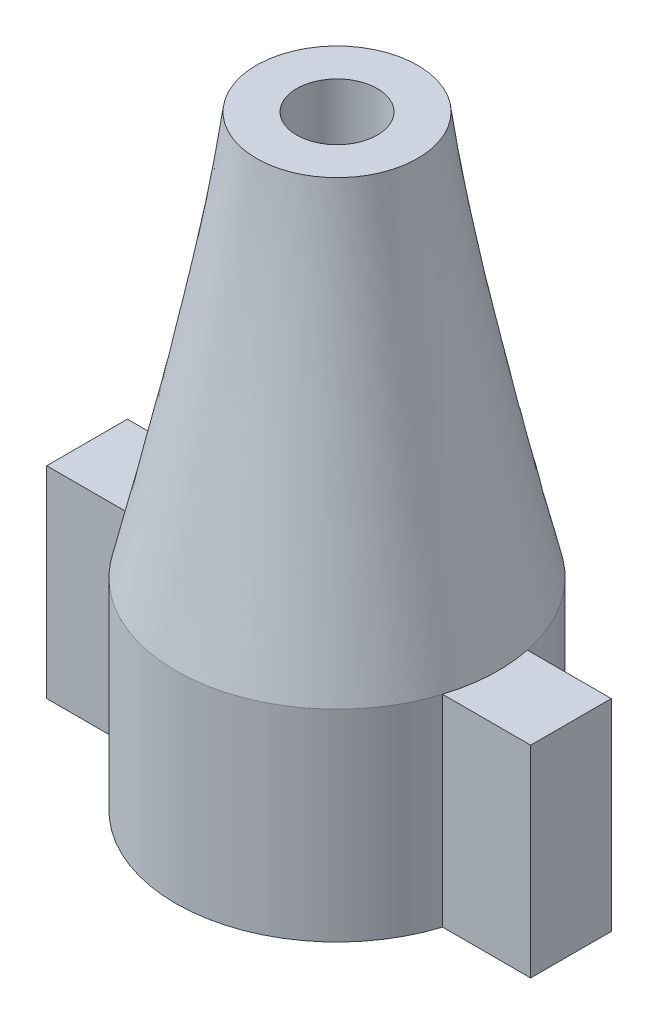
ISO-10303-21;
HEADER;
FILE_DESCRIPTION(('STEP AP214'),'2;1');
FILE_NAME('part.step','',(''),(''),'','','');
FILE_SCHEMA(('AUTOMOTIVE_DESIGN { 1 0 10303 214 1 1 1 1 }'));
ENDSEC;
DATA;
#1=APPLICATION_CONTEXT('core data for automotive mechanical design processes');
#2=APPLICATION_PROTOCOL_DEFINITION('international standard','automotive_design',2000,#1);
#3=PRODUCT_CONTEXT('',#1,'mechanical');
#4=PRODUCT('Part','Part','',(#3));
#5=PRODUCT_RELATED_PRODUCT_CATEGORY('part','',(#4));
#6=PRODUCT_DEFINITION_FORMATION('','',#4);
#7=PRODUCT_DEFINITION_CONTEXT('part definition',#1,'design');
#8=PRODUCT_DEFINITION('design','',#6,#7);
#9=PRODUCT_DEFINITION_SHAPE('','',#8);
#10=(LENGTH_UNIT() NAMED_UNIT(*) SI_UNIT(.MILLI.,.METRE.));
#11=(NAMED_UNIT(*) PLANE_ANGLE_UNIT() SI_UNIT($,.RADIAN.));
#12=(NAMED_UNIT(*) SI_UNIT($,.STERADIAN.) SOLID_ANGLE_UNIT());
#13=UNCERTAINTY_MEASURE_WITH_UNIT(LENGTH_MEASURE(1.E-05),#10,'distance_accuracy_value','');
#14=(GEOMETRIC_REPRESENTATION_CONTEXT(3) GLOBAL_UNCERTAINTY_ASSIGNED_CONTEXT((#13)) GLOBAL_UNIT_ASSIGNED_CONTEXT((#10,
#11,#12)) REPRESENTATION_CONTEXT('',''));
#15=CARTESIAN_POINT('',(0.,0.,0.));
#16=DIRECTION('',(0.,0.,1.));
#17=DIRECTION('',(1.,0.,0.));
#18=AXIS2_PLACEMENT_3D('',#15,#16,#17);
#19=CARTESIAN_POINT('',(0.,-5.,0.));
#20=DIRECTION('',(0.,1.,0.));
#21=DIRECTION('',(0.,0.,1.));
#22=AXIS2_PLACEMENT_3D('',#19,#20,#21);
#23=CYLINDRICAL_SURFACE('',#22,4.);
#24=CARTESIAN_POINT('',(0.,-5.,0.));
#25=DIRECTION('',(0.,-1.,0.));
#26=DIRECTION('',(0.,0.,-1.));
#27=AXIS2_PLACEMENT_3D('',#24,#25,#26);
#28=CIRCLE('',#27,4.);
#29=CARTESIAN_POINT('',(-3.91905509174876,-5.,-0.800629244930589));
#30=VERTEX_POINT('',#29);
#31=CARTESIAN_POINT('',(3.91905509174876,-5.,-0.800629244930588));
#32=VERTEX_POINT('',#31);
#33=EDGE_CURVE('E189',#30,#32,#28,.T.);
#34=ORIENTED_EDGE('',*,*,#33,.F.);
#35=DIRECTION('',(0.,1.,0.));
#36=VECTOR('',#35,1.);
#37=CARTESIAN_POINT('',(-3.91905509174876,-5.,-0.800629244930588));
#38=LINE('',#37,#36);
#39=CARTESIAN_POINT('',(-3.91905509174876,0.,-0.800629244930588));
#40=VERTEX_POINT('',#39);
#41=EDGE_CURVE('E12',#30,#40,#38,.T.);
#42=ORIENTED_EDGE('',*,*,#41,.T.);
#43=CARTESIAN_POINT('',(0.,0.,0.));
#44=DIRECTION('',(0.,-1.,0.));
#45=DIRECTION('',(0.,0.,-1.));
#46=AXIS2_PLACEMENT_3D('',#43,#44,#45);
#47=CIRCLE('',#46,4.);
#48=CARTESIAN_POINT('',(3.91905509174876,0.,-0.800629244930588));
#49=VERTEX_POINT('',#48);
#50=EDGE_CURVE('E239',#40,#49,#47,.T.);
#51=ORIENTED_EDGE('',*,*,#50,.T.);
#52=DIRECTION('',(0.,1.,0.));
#53=VECTOR('',#52,1.);
#54=CARTESIAN_POINT('',(3.91905509174876,-5.,-0.800629244930588));
#55=LINE('',#54,#53);
#56=EDGE_CURVE('E278',#49,#32,#55,.F.);
#57=ORIENTED_EDGE('',*,*,#56,.T.);
#58=EDGE_LOOP('',(#34,#42,#51,#57));
#59=FACE_BOUND('',#58,.T.);
#60=ADVANCED_FACE('F62',(#59),#23,.T.);
#61=CARTESIAN_POINT('',(0.,10.,0.));
#62=DIRECTION('',(0.,1.,0.));
#63=DIRECTION('',(0.,0.,1.));
#64=AXIS2_PLACEMENT_3D('',#61,#62,#63);
#65=PLANE('',#64);
#66=CARTESIAN_POINT('',(0.,10.,0.));
#67=DIRECTION('',(0.,1.,0.));
#68=DIRECTION('',(0.,0.,1.));
#69=AXIS2_PLACEMENT_3D('',#66,#67,#68);
#70=CIRCLE('',#69,1.);
#71=CARTESIAN_POINT('',(0.,10.,1.));
#72=VERTEX_POINT('',#71);
#73=EDGE_CURVE('E148',#72,#72,#70,.T.);
#74=ORIENTED_EDGE('',*,*,#73,.F.);
#75=EDGE_LOOP('',(#74));
#76=FACE_BOUND('',#75,.T.);
#77=CARTESIAN_POINT('',(0.,10.,0.));
#78=DIRECTION('',(0.,1.,0.));
#79=DIRECTION('',(0.,0.,1.));
#80=AXIS2_PLACEMENT_3D('',#77,#78,#79);
#81=CIRCLE('',#80,2.);
#82=CARTESIAN_POINT('',(0.,10.,2.));
#83=VERTEX_POINT('',#82);
#84=EDGE_CURVE('E188',#83,#83,#81,.F.);
#85=ORIENTED_EDGE('',*,*,#84,.F.);
#86=EDGE_LOOP('',(#85));
#87=FACE_BOUND('',#86,.T.);
#88=ADVANCED_FACE('F64',(#76,#87),#65,.T.);
#89=CARTESIAN_POINT('',(3.5279812011762,0.,1.88503279657075));
#90=CARTESIAN_POINT('',(1.98531269592162,10.,-0.241936974049907));
#91=CARTESIAN_POINT('',(7.2980467943177,0.,-5.17092960578165));
#92=CARTESIAN_POINT('',(1.50143874782181,10.,-4.21256236589315));
#93=CARTESIAN_POINT('',(0.242084391965302,0.,-8.94099519892315));
#94=CARTESIAN_POINT('',(-2.46918664402143,10.,-3.72868841779334));
#95=CARTESIAN_POINT('',(-3.5279812011762,0.,-1.88503279657075));
#96=CARTESIAN_POINT('',(-1.98531269592162,10.,0.241936974049907));
#97=CARTESIAN_POINT('',(-7.2980467943177,0.,5.17092960578165));
#98=CARTESIAN_POINT('',(-1.50143874782181,10.,4.21256236589315));
#99=CARTESIAN_POINT('',(-0.242084391965299,0.,8.94099519892315));
#100=CARTESIAN_POINT('',(2.46918664402143,10.,3.72868841779333));
#101=CARTESIAN_POINT('',(3.5279812011762,0.,1.88503279657075));
#102=CARTESIAN_POINT('',(1.98531269592162,10.,-0.241936974049907));
#103=(BOUNDED_SURFACE() B_SPLINE_SURFACE(3,1,((#89,#90),(#91,#92),(#93,#94),(#95,#96),(#97,#98),
(#99,#100),(#101,#102)),.UNSPECIFIED.,.T.,.F.,.F.) B_SPLINE_SURFACE_WITH_KNOTS((4,3,4),(2,2),
(0.,0.5,1.),(0.,1.),
.UNSPECIFIED.) GEOMETRIC_REPRESENTATION_ITEM() RATIONAL_B_SPLINE_SURFACE(((1.,1.),
(0.333333333333333,0.333333333333333),(0.333333333333333,0.333333333333333),(1.,1.),
(0.333333333333333,0.333333333333333),(0.333333333333333,0.333333333333333),(1.,1.))) REPRESENTATION_ITEM('') SURFACE());
#104=CARTESIAN_POINT('',(3.81595463703176,0.,1.19937075506941));
#105=VERTEX_POINT('',#104);
#106=EDGE_CURVE('E241',#49,#105,#47,.T.);
#107=CARTESIAN_POINT('',(0.,0.,0.));
#108=DIRECTION('',(0.,1.,0.));
#109=DIRECTION('',(0.,0.,1.));
#110=AXIS2_PLACEMENT_3D('',#107,#108,#109);
#111=CIRCLE('',#110,4.);
#112=CARTESIAN_POINT('',(-3.81595463703176,0.,1.19937075506941));
#113=VERTEX_POINT('',#112);
#114=EDGE_CURVE('E255',#40,#113,#111,.T.);
#115=EDGE_CURVE('E253',#105,#113,#47,.T.);
#116=ORIENTED_EDGE('',*,*,#106,.F.);
#117=ORIENTED_EDGE('',*,*,#50,.F.);
#118=ORIENTED_EDGE('',*,*,#114,.T.);
#119=ORIENTED_EDGE('',*,*,#115,.F.);
#120=EDGE_LOOP('',(#116,#117,#118,#119));
#121=FACE_BOUND('',#120,.T.);
#122=ORIENTED_EDGE('',*,*,#84,.T.);
#123=EDGE_LOOP('',(#122));
#124=FACE_BOUND('',#123,.T.);
#125=ADVANCED_FACE('F196',(#121,#124),#103,.T.);
#126=CARTESIAN_POINT('',(0.,-5.,0.));
#127=DIRECTION('',(0.,-1.,0.));
#128=DIRECTION('',(0.,0.,-1.));
#129=AXIS2_PLACEMENT_3D('',#126,#127,#128);
#130=PLANE('',#129);
#131=CARTESIAN_POINT('',(0.,-5.,0.));
#132=DIRECTION('',(0.,-1.,0.));
#133=DIRECTION('',(0.,0.,-1.));
#134=AXIS2_PLACEMENT_3D('',#131,#132,#133);
#135=CIRCLE('',#134,2.75);
#136=CARTESIAN_POINT('',(0.,-5.,-2.75));
#137=VERTEX_POINT('',#136);
#138=EDGE_CURVE('E142',#137,#137,#135,.T.);
#139=ORIENTED_EDGE('',*,*,#138,.F.);
#140=EDGE_LOOP('',(#139));
#141=FACE_BOUND('',#140,.T.);
#142=CARTESIAN_POINT('',(3.81595463703177,-5.,1.19937075506941));
#143=VERTEX_POINT('',#142);
#144=CARTESIAN_POINT('',(-3.81595463703176,-5.,1.19937075506941));
#145=VERTEX_POINT('',#144);
#146=EDGE_CURVE('E186',#143,#145,#28,.T.);
#147=ORIENTED_EDGE('',*,*,#146,.T.);
#148=DIRECTION('',(-1.,0.,0.));
#149=VECTOR('',#148,1.);
#150=CARTESIAN_POINT('',(-2.55,-5.,1.19937075506941));
#151=LINE('',#150,#149);
#152=CARTESIAN_POINT('',(-6.,-5.,1.19937075506941));
#153=VERTEX_POINT('',#152);
#154=EDGE_CURVE('E266',#145,#153,#151,.T.);
#155=ORIENTED_EDGE('',*,*,#154,.T.);
#156=DIRECTION('',(0.,0.,-1.));
#157=VECTOR('',#156,1.);
#158=CARTESIAN_POINT('',(-6.,-5.,-0.800629244930588));
#159=LINE('',#158,#157);
#160=CARTESIAN_POINT('',(-6.,-5.,-0.800629244930588));
#161=VERTEX_POINT('',#160);
#162=EDGE_CURVE('E166',#153,#161,#159,.T.);
#163=ORIENTED_EDGE('',*,*,#162,.T.);
#164=DIRECTION('',(1.,0.,0.));
#165=VECTOR('',#164,1.);
#166=CARTESIAN_POINT('',(-2.55,-5.,-0.800629244930588));
#167=LINE('',#166,#165);
#168=EDGE_CURVE('E79',#161,#30,#167,.T.);
#169=ORIENTED_EDGE('',*,*,#168,.T.);
#170=ORIENTED_EDGE('',*,*,#33,.T.);
#171=DIRECTION('',(1.,0.,0.));
#172=VECTOR('',#171,1.);
#173=CARTESIAN_POINT('',(2.55,-5.,-0.800629244930588));
#174=LINE('',#173,#172);
#175=CARTESIAN_POINT('',(6.,-5.,-0.800629244930588));
#176=VERTEX_POINT('',#175);
#177=EDGE_CURVE('E258',#32,#176,#174,.T.);
#178=ORIENTED_EDGE('',*,*,#177,.T.);
#179=DIRECTION('',(0.,0.,1.));
#180=VECTOR('',#179,1.);
#181=CARTESIAN_POINT('',(6.,-5.,1.19937075506941));
#182=LINE('',#181,#180);
#183=CARTESIAN_POINT('',(6.,-5.,1.19937075506941));
#184=VERTEX_POINT('',#183);
#185=EDGE_CURVE('E181',#176,#184,#182,.T.);
#186=ORIENTED_EDGE('',*,*,#185,.T.);
#187=DIRECTION('',(-1.,0.,0.));
#188=VECTOR('',#187,1.);
#189=CARTESIAN_POINT('',(2.55,-5.,1.19937075506941));
#190=LINE('',#189,#188);
#191=EDGE_CURVE('E86',#184,#143,#190,.T.);
#192=ORIENTED_EDGE('',*,*,#191,.T.);
#193=EDGE_LOOP('',(#147,#155,#163,#169,#170,#178,#186,#192));
#194=FACE_BOUND('',#193,.T.);
#195=ADVANCED_FACE('F207',(#141,#194),#130,.T.);
#196=ORIENTED_EDGE('',*,*,#115,.T.);
#197=DIRECTION('',(0.,1.,0.));
#198=VECTOR('',#197,1.);
#199=CARTESIAN_POINT('',(-3.81595463703176,-5.,1.19937075506941));
#200=LINE('',#199,#198);
#201=EDGE_CURVE('E71',#113,#145,#200,.F.);
#202=ORIENTED_EDGE('',*,*,#201,.T.);
#203=ORIENTED_EDGE('',*,*,#146,.F.);
#204=DIRECTION('',(0.,1.,0.));
#205=VECTOR('',#204,1.);
#206=CARTESIAN_POINT('',(3.81595463703176,-5.,1.19937075506941));
#207=LINE('',#206,#205);
#208=EDGE_CURVE('E248',#143,#105,#207,.T.);
#209=ORIENTED_EDGE('',*,*,#208,.T.);
#210=EDGE_LOOP('',(#196,#202,#203,#209));
#211=FACE_BOUND('',#210,.T.);
#212=ADVANCED_FACE('F209',(#211),#23,.T.);
#213=CARTESIAN_POINT('',(2.55,0.,1.19937075506941));
#214=DIRECTION('',(0.,0.,1.));
#215=DIRECTION('',(1.,0.,0.));
#216=AXIS2_PLACEMENT_3D('',#213,#214,#215);
#217=PLANE('',#216);
#218=ORIENTED_EDGE('',*,*,#208,.F.);
#219=ORIENTED_EDGE('',*,*,#191,.F.);
#220=DIRECTION('',(0.,-1.,0.));
#221=VECTOR('',#220,1.);
#222=CARTESIAN_POINT('',(6.,0.,1.19937075506941));
#223=LINE('',#222,#221);
#224=CARTESIAN_POINT('',(6.,0.,1.19937075506941));
#225=VERTEX_POINT('',#224);
#226=EDGE_CURVE('E280',#225,#184,#223,.T.);
#227=ORIENTED_EDGE('',*,*,#226,.F.);
#228=DIRECTION('',(-1.,0.,0.));
#229=VECTOR('',#228,1.);
#230=CARTESIAN_POINT('',(2.55,0.,1.19937075506941));
#231=LINE('',#230,#229);
#232=EDGE_CURVE('E176',#225,#105,#231,.T.);
#233=ORIENTED_EDGE('',*,*,#232,.T.);
#234=EDGE_LOOP('',(#218,#219,#227,#233));
#235=FACE_BOUND('',#234,.T.);
#236=ADVANCED_FACE('F218',(#235),#217,.T.);
#237=CARTESIAN_POINT('',(2.55,0.,-0.800629244930588));
#238=DIRECTION('',(0.,0.,-1.));
#239=DIRECTION('',(-1.,0.,0.));
#240=AXIS2_PLACEMENT_3D('',#237,#238,#239);
#241=PLANE('',#240);
#242=ORIENTED_EDGE('',*,*,#56,.F.);
#243=DIRECTION('',(1.,0.,0.));
#244=VECTOR('',#243,1.);
#245=CARTESIAN_POINT('',(2.55,0.,-0.800629244930588));
#246=LINE('',#245,#244);
#247=CARTESIAN_POINT('',(6.,0.,-0.800629244930588));
#248=VERTEX_POINT('',#247);
#249=EDGE_CURVE('E180',#49,#248,#246,.T.);
#250=ORIENTED_EDGE('',*,*,#249,.T.);
#251=DIRECTION('',(0.,-1.,0.));
#252=VECTOR('',#251,1.);
#253=CARTESIAN_POINT('',(6.,0.,-0.800629244930588));
#254=LINE('',#253,#252);
#255=EDGE_CURVE('E182',#248,#176,#254,.T.);
#256=ORIENTED_EDGE('',*,*,#255,.T.);
#257=ORIENTED_EDGE('',*,*,#177,.F.);
#258=EDGE_LOOP('',(#242,#250,#256,#257));
#259=FACE_BOUND('',#258,.T.);
#260=ADVANCED_FACE('F340',(#259),#241,.T.);
#261=CARTESIAN_POINT('',(0.,0.,0.));
#262=DIRECTION('',(0.,1.,0.));
#263=DIRECTION('',(0.,0.,1.));
#264=AXIS2_PLACEMENT_3D('',#261,#262,#263);
#265=PLANE('',#264);
#266=ORIENTED_EDGE('',*,*,#106,.T.);
#267=ORIENTED_EDGE('',*,*,#232,.F.);
#268=DIRECTION('',(0.,0.,1.));
#269=VECTOR('',#268,1.);
#270=CARTESIAN_POINT('',(6.,0.,1.19937075506941));
#271=LINE('',#270,#269);
#272=EDGE_CURVE('E185',#248,#225,#271,.T.);
#273=ORIENTED_EDGE('',*,*,#272,.F.);
#274=ORIENTED_EDGE('',*,*,#249,.F.);
#275=EDGE_LOOP('',(#266,#267,#273,#274));
#276=FACE_BOUND('',#275,.T.);
#277=ADVANCED_FACE('F293',(#276),#265,.T.);
#278=CARTESIAN_POINT('',(6.,0.,1.19937075506941));
#279=DIRECTION('',(1.,0.,0.));
#280=DIRECTION('',(0.,0.,-1.));
#281=AXIS2_PLACEMENT_3D('',#278,#279,#280);
#282=PLANE('',#281);
#283=ORIENTED_EDGE('',*,*,#185,.F.);
#284=ORIENTED_EDGE('',*,*,#255,.F.);
#285=ORIENTED_EDGE('',*,*,#272,.T.);
#286=ORIENTED_EDGE('',*,*,#226,.T.);
#287=EDGE_LOOP('',(#283,#284,#285,#286));
#288=FACE_BOUND('',#287,.T.);
#289=ADVANCED_FACE('F289',(#288),#282,.T.);
#290=CARTESIAN_POINT('',(-2.55,0.,-0.800629244930588));
#291=DIRECTION('',(0.,0.,-1.));
#292=DIRECTION('',(-1.,0.,0.));
#293=AXIS2_PLACEMENT_3D('',#290,#291,#292);
#294=PLANE('',#293);
#295=ORIENTED_EDGE('',*,*,#41,.F.);
#296=ORIENTED_EDGE('',*,*,#168,.F.);
#297=DIRECTION('',(0.,-1.,0.));
#298=VECTOR('',#297,1.);
#299=CARTESIAN_POINT('',(-6.,0.,-0.800629244930588));
#300=LINE('',#299,#298);
#301=CARTESIAN_POINT('',(-6.,0.,-0.800629244930588));
#302=VERTEX_POINT('',#301);
#303=EDGE_CURVE('E256',#302,#161,#300,.T.);
#304=ORIENTED_EDGE('',*,*,#303,.F.);
#305=DIRECTION('',(1.,0.,0.));
#306=VECTOR('',#305,1.);
#307=CARTESIAN_POINT('',(-2.55,0.,-0.800629244930588));
#308=LINE('',#307,#306);
#309=EDGE_CURVE('E161',#302,#40,#308,.T.);
#310=ORIENTED_EDGE('',*,*,#309,.T.);
#311=EDGE_LOOP('',(#295,#296,#304,#310));
#312=FACE_BOUND('',#311,.T.);
#313=ADVANCED_FACE('F276',(#312),#294,.T.);
#314=CARTESIAN_POINT('',(-2.55,0.,1.19937075506941));
#315=DIRECTION('',(0.,0.,1.));
#316=DIRECTION('',(1.,0.,0.));
#317=AXIS2_PLACEMENT_3D('',#314,#315,#316);
#318=PLANE('',#317);
#319=ORIENTED_EDGE('',*,*,#201,.F.);
#320=DIRECTION('',(-1.,0.,0.));
#321=VECTOR('',#320,1.);
#322=CARTESIAN_POINT('',(-2.55,0.,1.19937075506941));
#323=LINE('',#322,#321);
#324=CARTESIAN_POINT('',(-6.,0.,1.19937075506941));
#325=VERTEX_POINT('',#324);
#326=EDGE_CURVE('E165',#113,#325,#323,.T.);
#327=ORIENTED_EDGE('',*,*,#326,.T.);
#328=DIRECTION('',(0.,-1.,0.));
#329=VECTOR('',#328,1.);
#330=CARTESIAN_POINT('',(-6.,0.,1.19937075506941));
#331=LINE('',#330,#329);
#332=EDGE_CURVE('E167',#325,#153,#331,.T.);
#333=ORIENTED_EDGE('',*,*,#332,.T.);
#334=ORIENTED_EDGE('',*,*,#154,.F.);
#335=EDGE_LOOP('',(#319,#327,#333,#334));
#336=FACE_BOUND('',#335,.T.);
#337=ADVANCED_FACE('F330',(#336),#318,.T.);
#338=CARTESIAN_POINT('',(0.,0.,0.));
#339=DIRECTION('',(0.,1.,0.));
#340=DIRECTION('',(0.,0.,1.));
#341=AXIS2_PLACEMENT_3D('',#338,#339,#340);
#342=PLANE('',#341);
#343=ORIENTED_EDGE('',*,*,#114,.F.);
#344=ORIENTED_EDGE('',*,*,#309,.F.);
#345=DIRECTION('',(0.,0.,-1.));
#346=VECTOR('',#345,1.);
#347=CARTESIAN_POINT('',(-6.,0.,-0.800629244930588));
#348=LINE('',#347,#346);
#349=EDGE_CURVE('E170',#325,#302,#348,.T.);
#350=ORIENTED_EDGE('',*,*,#349,.F.);
#351=ORIENTED_EDGE('',*,*,#326,.F.);
#352=EDGE_LOOP('',(#343,#344,#350,#351));
#353=FACE_BOUND('',#352,.T.);
#354=ADVANCED_FACE('F274',(#353),#342,.T.);
#355=CARTESIAN_POINT('',(-6.,0.,-0.800629244930588));
#356=DIRECTION('',(-1.,0.,0.));
#357=DIRECTION('',(0.,0.,1.));
#358=AXIS2_PLACEMENT_3D('',#355,#356,#357);
#359=PLANE('',#358);
#360=ORIENTED_EDGE('',*,*,#162,.F.);
#361=ORIENTED_EDGE('',*,*,#332,.F.);
#362=ORIENTED_EDGE('',*,*,#349,.T.);
#363=ORIENTED_EDGE('',*,*,#303,.T.);
#364=EDGE_LOOP('',(#360,#361,#362,#363));
#365=FACE_BOUND('',#364,.T.);
#366=ADVANCED_FACE('F270',(#365),#359,.T.);
#367=CARTESIAN_POINT('',(0.,0.,0.));
#368=DIRECTION('',(0.,-1.,0.));
#369=DIRECTION('',(0.,0.,-1.));
#370=AXIS2_PLACEMENT_3D('',#367,#368,#369);
#371=CYLINDRICAL_SURFACE('',#370,2.75);
#372=CARTESIAN_POINT('',(0.,0.,0.));
#373=DIRECTION('',(0.,1.,0.));
#374=DIRECTION('',(0.,0.,1.));
#375=AXIS2_PLACEMENT_3D('',#372,#373,#374);
#376=CIRCLE('',#375,2.75);
#377=CARTESIAN_POINT('',(0.,0.,2.75));
#378=VERTEX_POINT('',#377);
#379=EDGE_CURVE('E140',#378,#378,#376,.T.);
#380=ORIENTED_EDGE('',*,*,#379,.T.);
#381=EDGE_LOOP('',(#380));
#382=FACE_BOUND('',#381,.T.);
#383=ORIENTED_EDGE('',*,*,#138,.T.);
#384=EDGE_LOOP('',(#383));
#385=FACE_BOUND('',#384,.T.);
#386=ADVANCED_FACE('F136',(#382,#385),#371,.F.);
#387=CARTESIAN_POINT('',(2.75,0.,0.));
#388=CARTESIAN_POINT('',(2.61984920581438,1.77145222827966,0.));
#389=CARTESIAN_POINT('',(0.,1.6,0.));
#390=B_SPLINE_CURVE_WITH_KNOTS('',2,(#387,#388,#389),.UNSPECIFIED.,.F.,.F.,(3,3),(0.,1.),.UNSPECIFIED.);
#391=CARTESIAN_POINT('',(0.,0.,0.));
#392=DIRECTION('',(0.,1.,0.));
#393=AXIS1_PLACEMENT('',#391,#392);
#394=SURFACE_OF_REVOLUTION('',#390,#393);
#395=CARTESIAN_POINT('',(0.,1.6,0.));
#396=VERTEX_POINT('',#395);
#397=VERTEX_LOOP('',#396);
#398=FACE_BOUND('',#397,.T.);
#399=ORIENTED_EDGE('',*,*,#379,.F.);
#400=EDGE_LOOP('',(#399));
#401=FACE_BOUND('',#400,.T.);
#402=ADVANCED_FACE('F132',(#398,#401),#394,.F.);
#403=CARTESIAN_POINT('',(0.,2.,0.));
#404=DIRECTION('',(0.,1.,0.));
#405=DIRECTION('',(0.,0.,1.));
#406=AXIS2_PLACEMENT_3D('',#403,#404,#405);
#407=CYLINDRICAL_SURFACE('',#406,1.);
#408=CARTESIAN_POINT('',(0.,2.,0.));
#409=DIRECTION('',(0.,1.,0.));
#410=DIRECTION('',(0.,0.,1.));
#411=AXIS2_PLACEMENT_3D('',#408,#409,#410);
#412=CIRCLE('',#411,1.);
#413=CARTESIAN_POINT('',(0.,2.,1.));
#414=VERTEX_POINT('',#413);
#415=EDGE_CURVE('E143',#414,#414,#412,.T.);
#416=ORIENTED_EDGE('',*,*,#415,.F.);
#417=EDGE_LOOP('',(#416));
#418=FACE_BOUND('',#417,.T.);
#419=ORIENTED_EDGE('',*,*,#73,.T.);
#420=EDGE_LOOP('',(#419));
#421=FACE_BOUND('',#420,.T.);
#422=ADVANCED_FACE('F135',(#418,#421),#407,.F.);
#423=CARTESIAN_POINT('',(0.,2.,0.));
#424=DIRECTION('',(0.,1.,0.));
#425=DIRECTION('',(0.,0.,1.));
#426=AXIS2_PLACEMENT_3D('',#423,#424,#425);
#427=PLANE('',#426);
#428=ORIENTED_EDGE('',*,*,#415,.T.);
#429=EDGE_LOOP('',(#428));
#430=FACE_BOUND('',#429,.T.);
#431=ADVANCED_FACE('F317',(#430),#427,.T.);
#432=CLOSED_SHELL('',(#60,#88,#125,#195,#212,#236,#260,#277,#289,#313,#337,#354,#366,#386,#402,
#422,#431));
#433=MANIFOLD_SOLID_BREP('B2',#432);
#434=ADVANCED_BREP_SHAPE_REPRESENTATION('',(#18,#433),#14);
#435=SHAPE_DEFINITION_REPRESENTATION(#9,#434);
ENDSEC;
END-ISO-10303-21;
